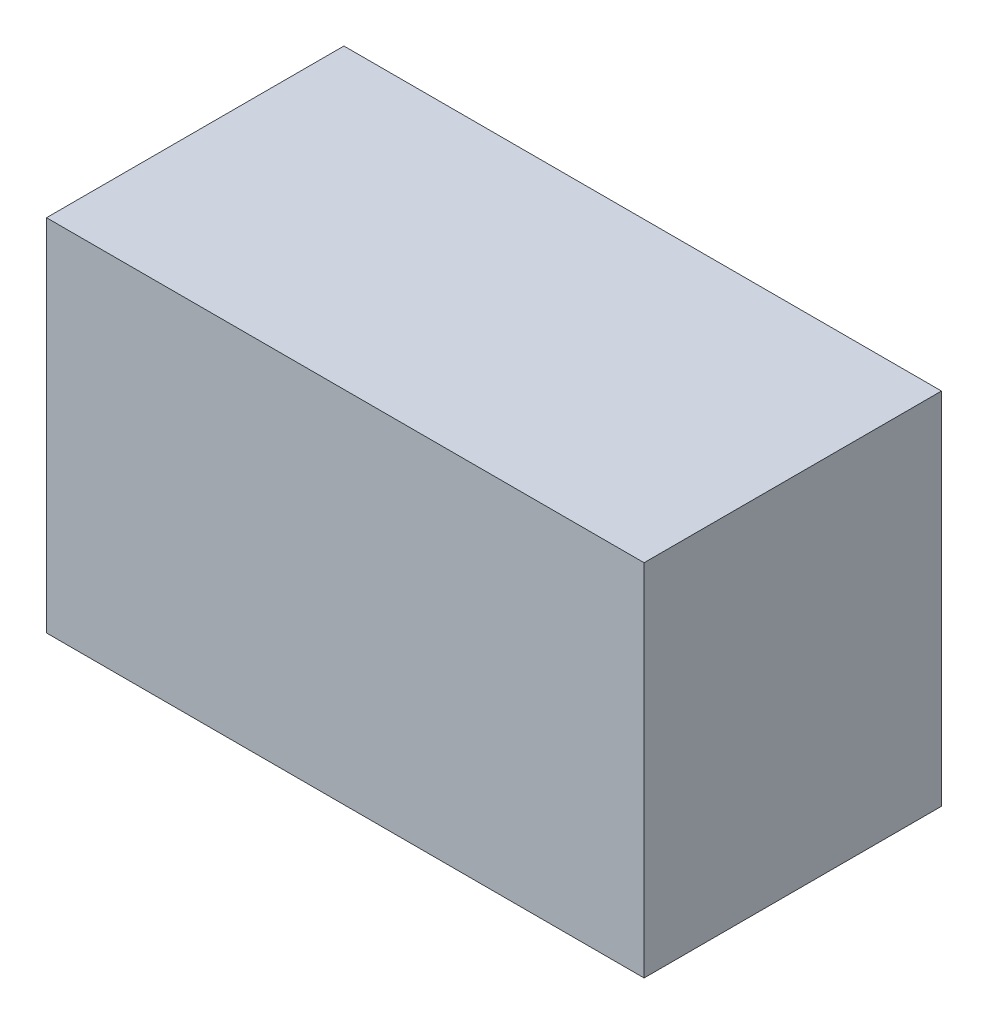
ISO-10303-21;
HEADER;
FILE_DESCRIPTION(('STEP AP214'),'2;1');
FILE_NAME('part.step','',(''),(''),'','','');
FILE_SCHEMA(('AUTOMOTIVE_DESIGN { 1 0 10303 214 1 1 1 1 }'));
ENDSEC;
DATA;
#1=APPLICATION_CONTEXT('core data for automotive mechanical design processes');
#2=APPLICATION_PROTOCOL_DEFINITION('international standard','automotive_design',2000,#1);
#3=PRODUCT_CONTEXT('',#1,'mechanical');
#4=PRODUCT('Part','Part','',(#3));
#5=PRODUCT_RELATED_PRODUCT_CATEGORY('part','',(#4));
#6=PRODUCT_DEFINITION_FORMATION('','',#4);
#7=PRODUCT_DEFINITION_CONTEXT('part definition',#1,'design');
#8=PRODUCT_DEFINITION('design','',#6,#7);
#9=PRODUCT_DEFINITION_SHAPE('','',#8);
#10=(LENGTH_UNIT() NAMED_UNIT(*) SI_UNIT(.MILLI.,.METRE.));
#11=(NAMED_UNIT(*) PLANE_ANGLE_UNIT() SI_UNIT($,.RADIAN.));
#12=(NAMED_UNIT(*) SI_UNIT($,.STERADIAN.) SOLID_ANGLE_UNIT());
#13=UNCERTAINTY_MEASURE_WITH_UNIT(LENGTH_MEASURE(1.E-05),#10,'distance_accuracy_value','');
#14=(GEOMETRIC_REPRESENTATION_CONTEXT(3) GLOBAL_UNCERTAINTY_ASSIGNED_CONTEXT((#13)) GLOBAL_UNIT_ASSIGNED_CONTEXT((#10,
#11,#12)) REPRESENTATION_CONTEXT('',''));
#15=CARTESIAN_POINT('',(0.,0.,0.));
#16=DIRECTION('',(0.,0.,1.));
#17=DIRECTION('',(1.,0.,0.));
#18=AXIS2_PLACEMENT_3D('',#15,#16,#17);
#19=CARTESIAN_POINT('',(-2.16000076,1.29999994,0.0499999));
#20=DIRECTION('',(1.,0.,0.));
#21=DIRECTION('',(0.,-1.,0.));
#22=AXIS2_PLACEMENT_3D('',#19,#20,#21);
#23=PLANE('',#22);
#24=DIRECTION('',(0.,-1.,0.));
#25=VECTOR('',#24,1.);
#26=CARTESIAN_POINT('',(-2.16000076,1.29999994,0.0499999));
#27=LINE('',#26,#25);
#28=CARTESIAN_POINT('',(-2.16000076,1.29999994,0.0499999));
#29=VERTEX_POINT('',#28);
#30=CARTESIAN_POINT('',(-2.16000076,-1.29999994,0.0499999));
#31=VERTEX_POINT('',#30);
#32=EDGE_CURVE('E10',#29,#31,#27,.T.);
#33=ORIENTED_EDGE('',*,*,#32,.T.);
#34=DIRECTION('',(0.,0.,1.));
#35=VECTOR('',#34,1.);
#36=CARTESIAN_POINT('',(-2.16000076,-1.29999994,0.0499999));
#37=LINE('',#36,#35);
#38=CARTESIAN_POINT('',(-2.16000076,-1.29999994,2.20000068));
#39=VERTEX_POINT('',#38);
#40=EDGE_CURVE('E23',#31,#39,#37,.T.);
#41=ORIENTED_EDGE('',*,*,#40,.T.);
#42=DIRECTION('',(0.,-1.,0.));
#43=VECTOR('',#42,1.);
#44=CARTESIAN_POINT('',(-2.16000076,1.29999994,2.20000068));
#45=LINE('',#44,#43);
#46=CARTESIAN_POINT('',(-2.16000076,1.29999994,2.20000068));
#47=VERTEX_POINT('',#46);
#48=EDGE_CURVE('E85',#47,#39,#45,.T.);
#49=ORIENTED_EDGE('',*,*,#48,.F.);
#50=DIRECTION('',(0.,0.,1.));
#51=VECTOR('',#50,1.);
#52=CARTESIAN_POINT('',(-2.16000076,1.29999994,0.0499999));
#53=LINE('',#52,#51);
#54=EDGE_CURVE('E36',#29,#47,#53,.T.);
#55=ORIENTED_EDGE('',*,*,#54,.F.);
#56=EDGE_LOOP('',(#33,#41,#49,#55));
#57=FACE_BOUND('',#56,.T.);
#58=ADVANCED_FACE('F16',(#57),#23,.F.);
#59=CARTESIAN_POINT('',(-2.16000076,-1.29999994,0.0499999));
#60=DIRECTION('',(0.,1.,0.));
#61=DIRECTION('',(1.,0.,0.));
#62=AXIS2_PLACEMENT_3D('',#59,#60,#61);
#63=PLANE('',#62);
#64=DIRECTION('',(1.,0.,0.));
#65=VECTOR('',#64,1.);
#66=CARTESIAN_POINT('',(-2.16000076,-1.29999994,0.0499999));
#67=LINE('',#66,#65);
#68=CARTESIAN_POINT('',(2.16000076,-1.29999994,0.0499999));
#69=VERTEX_POINT('',#68);
#70=EDGE_CURVE('E30',#31,#69,#67,.T.);
#71=ORIENTED_EDGE('',*,*,#70,.T.);
#72=DIRECTION('',(0.,0.,1.));
#73=VECTOR('',#72,1.);
#74=CARTESIAN_POINT('',(2.16000076,-1.29999994,0.0499999));
#75=LINE('',#74,#73);
#76=CARTESIAN_POINT('',(2.16000076,-1.29999994,2.20000068));
#77=VERTEX_POINT('',#76);
#78=EDGE_CURVE('E81',#69,#77,#75,.T.);
#79=ORIENTED_EDGE('',*,*,#78,.T.);
#80=DIRECTION('',(1.,0.,0.));
#81=VECTOR('',#80,1.);
#82=CARTESIAN_POINT('',(-2.16000076,-1.29999994,2.20000068));
#83=LINE('',#82,#81);
#84=EDGE_CURVE('E61',#39,#77,#83,.T.);
#85=ORIENTED_EDGE('',*,*,#84,.F.);
#86=ORIENTED_EDGE('',*,*,#40,.F.);
#87=EDGE_LOOP('',(#71,#79,#85,#86));
#88=FACE_BOUND('',#87,.T.);
#89=ADVANCED_FACE('F89',(#88),#63,.F.);
#90=CARTESIAN_POINT('',(2.16000076,-1.29999994,0.0499999));
#91=DIRECTION('',(-1.,0.,0.));
#92=DIRECTION('',(0.,1.,0.));
#93=AXIS2_PLACEMENT_3D('',#90,#91,#92);
#94=PLANE('',#93);
#95=DIRECTION('',(0.,1.,0.));
#96=VECTOR('',#95,1.);
#97=CARTESIAN_POINT('',(2.16000076,-1.29999994,0.0499999));
#98=LINE('',#97,#96);
#99=CARTESIAN_POINT('',(2.16000076,1.29999994,0.0499999));
#100=VERTEX_POINT('',#99);
#101=EDGE_CURVE('E70',#69,#100,#98,.T.);
#102=ORIENTED_EDGE('',*,*,#101,.T.);
#103=DIRECTION('',(0.,0.,1.));
#104=VECTOR('',#103,1.);
#105=CARTESIAN_POINT('',(2.16000076,1.29999994,0.0499999));
#106=LINE('',#105,#104);
#107=CARTESIAN_POINT('',(2.16000076,1.29999994,2.20000068));
#108=VERTEX_POINT('',#107);
#109=EDGE_CURVE('E65',#100,#108,#106,.T.);
#110=ORIENTED_EDGE('',*,*,#109,.T.);
#111=DIRECTION('',(0.,1.,0.));
#112=VECTOR('',#111,1.);
#113=CARTESIAN_POINT('',(2.16000076,-1.29999994,2.20000068));
#114=LINE('',#113,#112);
#115=EDGE_CURVE('E55',#77,#108,#114,.T.);
#116=ORIENTED_EDGE('',*,*,#115,.F.);
#117=ORIENTED_EDGE('',*,*,#78,.F.);
#118=EDGE_LOOP('',(#102,#110,#116,#117));
#119=FACE_BOUND('',#118,.T.);
#120=ADVANCED_FACE('F69',(#119),#94,.F.);
#121=CARTESIAN_POINT('',(2.16000076,1.29999994,0.0499999));
#122=DIRECTION('',(0.,-1.,0.));
#123=DIRECTION('',(-1.,0.,0.));
#124=AXIS2_PLACEMENT_3D('',#121,#122,#123);
#125=PLANE('',#124);
#126=DIRECTION('',(-1.,0.,0.));
#127=VECTOR('',#126,1.);
#128=CARTESIAN_POINT('',(2.16000076,1.29999994,0.0499999));
#129=LINE('',#128,#127);
#130=EDGE_CURVE('E66',#100,#29,#129,.T.);
#131=ORIENTED_EDGE('',*,*,#130,.T.);
#132=ORIENTED_EDGE('',*,*,#54,.T.);
#133=DIRECTION('',(-1.,0.,0.));
#134=VECTOR('',#133,1.);
#135=CARTESIAN_POINT('',(2.16000076,1.29999994,2.20000068));
#136=LINE('',#135,#134);
#137=EDGE_CURVE('E60',#108,#47,#136,.T.);
#138=ORIENTED_EDGE('',*,*,#137,.F.);
#139=ORIENTED_EDGE('',*,*,#109,.F.);
#140=EDGE_LOOP('',(#131,#132,#138,#139));
#141=FACE_BOUND('',#140,.T.);
#142=ADVANCED_FACE('F75',(#141),#125,.F.);
#143=CARTESIAN_POINT('',(0.,0.,0.0499999));
#144=DIRECTION('',(0.,0.,1.));
#145=DIRECTION('',(1.,0.,0.));
#146=AXIS2_PLACEMENT_3D('',#143,#144,#145);
#147=PLANE('',#146);
#148=ORIENTED_EDGE('',*,*,#130,.F.);
#149=ORIENTED_EDGE('',*,*,#101,.F.);
#150=ORIENTED_EDGE('',*,*,#70,.F.);
#151=ORIENTED_EDGE('',*,*,#32,.F.);
#152=EDGE_LOOP('',(#148,#149,#150,#151));
#153=FACE_BOUND('',#152,.T.);
#154=ADVANCED_FACE('F90',(#153),#147,.F.);
#155=CARTESIAN_POINT('',(0.,0.,2.20000068));
#156=DIRECTION('',(0.,0.,1.));
#157=DIRECTION('',(1.,0.,0.));
#158=AXIS2_PLACEMENT_3D('',#155,#156,#157);
#159=PLANE('',#158);
#160=ORIENTED_EDGE('',*,*,#48,.T.);
#161=ORIENTED_EDGE('',*,*,#84,.T.);
#162=ORIENTED_EDGE('',*,*,#115,.T.);
#163=ORIENTED_EDGE('',*,*,#137,.T.);
#164=EDGE_LOOP('',(#160,#161,#162,#163));
#165=FACE_BOUND('',#164,.T.);
#166=ADVANCED_FACE('F58',(#165),#159,.T.);
#167=CLOSED_SHELL('',(#58,#89,#120,#142,#154,#166));
#168=MANIFOLD_SOLID_BREP('B1',#167);
#169=ADVANCED_BREP_SHAPE_REPRESENTATION('',(#18,#168),#14);
#170=SHAPE_DEFINITION_REPRESENTATION(#9,#169);
ENDSEC;
END-ISO-10303-21;
